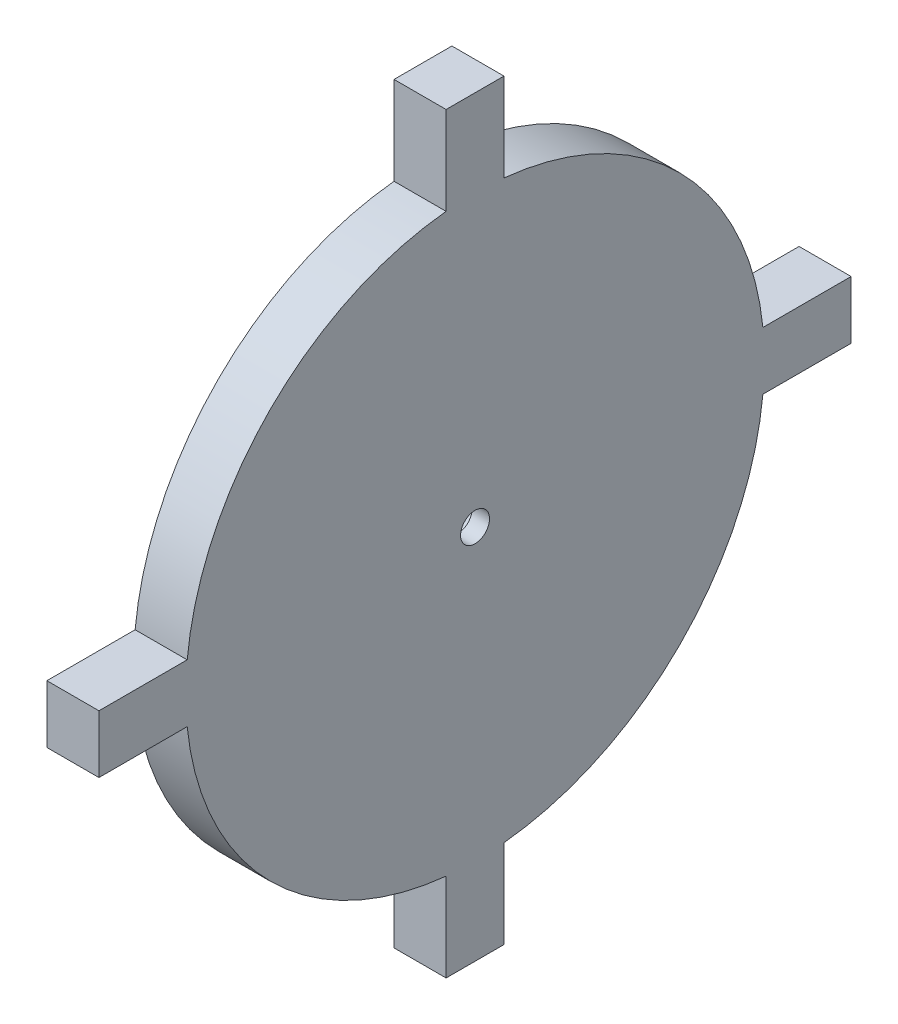
ISO-10303-21;
HEADER;
FILE_DESCRIPTION(('STEP AP214'),'2;1');
FILE_NAME('part.step','',(''),(''),'','','');
FILE_SCHEMA(('AUTOMOTIVE_DESIGN { 1 0 10303 214 1 1 1 1 }'));
ENDSEC;
DATA;
#1=APPLICATION_CONTEXT('core data for automotive mechanical design processes');
#2=APPLICATION_PROTOCOL_DEFINITION('international standard','automotive_design',2000,#1);
#3=PRODUCT_CONTEXT('',#1,'mechanical');
#4=PRODUCT('Part','Part','',(#3));
#5=PRODUCT_RELATED_PRODUCT_CATEGORY('part','',(#4));
#6=PRODUCT_DEFINITION_FORMATION('','',#4);
#7=PRODUCT_DEFINITION_CONTEXT('part definition',#1,'design');
#8=PRODUCT_DEFINITION('design','',#6,#7);
#9=PRODUCT_DEFINITION_SHAPE('','',#8);
#10=(LENGTH_UNIT() NAMED_UNIT(*) SI_UNIT(.MILLI.,.METRE.));
#11=(NAMED_UNIT(*) PLANE_ANGLE_UNIT() SI_UNIT($,.RADIAN.));
#12=(NAMED_UNIT(*) SI_UNIT($,.STERADIAN.) SOLID_ANGLE_UNIT());
#13=UNCERTAINTY_MEASURE_WITH_UNIT(LENGTH_MEASURE(1.E-05),#10,'distance_accuracy_value','');
#14=(GEOMETRIC_REPRESENTATION_CONTEXT(3) GLOBAL_UNCERTAINTY_ASSIGNED_CONTEXT((#13)) GLOBAL_UNIT_ASSIGNED_CONTEXT((#10,
#11,#12)) REPRESENTATION_CONTEXT('',''));
#15=CARTESIAN_POINT('',(0.,0.,0.));
#16=DIRECTION('',(0.,0.,1.));
#17=DIRECTION('',(1.,0.,0.));
#18=AXIS2_PLACEMENT_3D('',#15,#16,#17);
#19=CARTESIAN_POINT('',(11.43,0.,0.));
#20=DIRECTION('',(-1.,0.,0.));
#21=DIRECTION('',(0.,0.,1.));
#22=AXIS2_PLACEMENT_3D('',#19,#20,#21);
#23=CYLINDRICAL_SURFACE('',#22,3.175);
#24=CARTESIAN_POINT('',(11.43,0.,0.));
#25=DIRECTION('',(1.,0.,0.));
#26=DIRECTION('',(0.,0.,-1.));
#27=AXIS2_PLACEMENT_3D('',#24,#25,#26);
#28=CIRCLE('',#27,3.175);
#29=CARTESIAN_POINT('',(11.43,0.,-3.175));
#30=VERTEX_POINT('',#29);
#31=EDGE_CURVE('E176',#30,#30,#28,.T.);
#32=ORIENTED_EDGE('',*,*,#31,.T.);
#33=EDGE_LOOP('',(#32));
#34=FACE_BOUND('',#33,.T.);
#35=CARTESIAN_POINT('',(7.62,0.,0.));
#36=DIRECTION('',(-1.,0.,0.));
#37=DIRECTION('',(0.,0.,1.));
#38=AXIS2_PLACEMENT_3D('',#35,#36,#37);
#39=CIRCLE('',#38,3.175);
#40=CARTESIAN_POINT('',(7.62,0.,3.175));
#41=VERTEX_POINT('',#40);
#42=EDGE_CURVE('E39',#41,#41,#39,.T.);
#43=ORIENTED_EDGE('',*,*,#42,.T.);
#44=EDGE_LOOP('',(#43));
#45=FACE_BOUND('',#44,.T.);
#46=ADVANCED_FACE('F35',(#34,#45),#23,.F.);
#47=CARTESIAN_POINT('',(11.43,0.,0.));
#48=DIRECTION('',(-1.,0.,0.));
#49=DIRECTION('',(0.,0.,1.));
#50=AXIS2_PLACEMENT_3D('',#47,#48,#49);
#51=CYLINDRICAL_SURFACE('',#50,63.5);
#52=CARTESIAN_POINT('',(0.,0.,0.));
#53=DIRECTION('',(1.,0.,0.));
#54=DIRECTION('',(0.,0.,-1.));
#55=AXIS2_PLACEMENT_3D('',#52,#53,#54);
#56=CIRCLE('',#55,63.5);
#57=CARTESIAN_POINT('',(0.,63.1817022562704,6.35000000000001));
#58=VERTEX_POINT('',#57);
#59=CARTESIAN_POINT('',(0.,6.35,63.1817022562704));
#60=VERTEX_POINT('',#59);
#61=EDGE_CURVE('E183',#58,#60,#56,.T.);
#62=ORIENTED_EDGE('',*,*,#61,.T.);
#63=DIRECTION('',(-1.,0.,0.));
#64=VECTOR('',#63,1.);
#65=CARTESIAN_POINT('',(11.43,6.35,63.1817022562704));
#66=LINE('',#65,#64);
#67=CARTESIAN_POINT('',(11.43,6.35,63.1817022562704));
#68=VERTEX_POINT('',#67);
#69=EDGE_CURVE('E11',#68,#60,#66,.T.);
#70=ORIENTED_EDGE('',*,*,#69,.F.);
#71=CARTESIAN_POINT('',(11.43,0.,0.));
#72=DIRECTION('',(1.,0.,0.));
#73=DIRECTION('',(0.,0.,-1.));
#74=AXIS2_PLACEMENT_3D('',#71,#72,#73);
#75=CIRCLE('',#74,63.5);
#76=CARTESIAN_POINT('',(11.43,63.1817022562704,6.35000000000001));
#77=VERTEX_POINT('',#76);
#78=EDGE_CURVE('E113',#77,#68,#75,.T.);
#79=ORIENTED_EDGE('',*,*,#78,.F.);
#80=DIRECTION('',(-1.,0.,0.));
#81=VECTOR('',#80,1.);
#82=CARTESIAN_POINT('',(11.43,63.1817022562704,6.35000000000001));
#83=LINE('',#82,#81);
#84=EDGE_CURVE('E182',#77,#58,#83,.T.);
#85=ORIENTED_EDGE('',*,*,#84,.T.);
#86=EDGE_LOOP('',(#62,#70,#79,#85));
#87=FACE_BOUND('',#86,.T.);
#88=ADVANCED_FACE('F37',(#87),#51,.T.);
#89=CARTESIAN_POINT('',(11.43,6.35,0.));
#90=DIRECTION('',(0.,1.,0.));
#91=DIRECTION('',(0.,0.,1.));
#92=AXIS2_PLACEMENT_3D('',#89,#90,#91);
#93=PLANE('',#92);
#94=DIRECTION('',(0.,0.,-1.));
#95=VECTOR('',#94,1.);
#96=CARTESIAN_POINT('',(0.,6.35,0.));
#97=LINE('',#96,#95);
#98=CARTESIAN_POINT('',(0.,6.35,82.55));
#99=VERTEX_POINT('',#98);
#100=EDGE_CURVE('E186',#99,#60,#97,.T.);
#101=ORIENTED_EDGE('',*,*,#100,.F.);
#102=DIRECTION('',(-1.,0.,0.));
#103=VECTOR('',#102,1.);
#104=CARTESIAN_POINT('',(11.43,6.35,82.55));
#105=LINE('',#104,#103);
#106=CARTESIAN_POINT('',(11.43,6.35,82.55));
#107=VERTEX_POINT('',#106);
#108=EDGE_CURVE('E45',#107,#99,#105,.T.);
#109=ORIENTED_EDGE('',*,*,#108,.F.);
#110=DIRECTION('',(0.,0.,-1.));
#111=VECTOR('',#110,1.);
#112=CARTESIAN_POINT('',(11.43,6.35,0.));
#113=LINE('',#112,#111);
#114=EDGE_CURVE('E563',#107,#68,#113,.T.);
#115=ORIENTED_EDGE('',*,*,#114,.T.);
#116=ORIENTED_EDGE('',*,*,#69,.T.);
#117=EDGE_LOOP('',(#101,#109,#115,#116));
#118=FACE_BOUND('',#117,.T.);
#119=ADVANCED_FACE('F258',(#118),#93,.T.);
#120=CARTESIAN_POINT('',(11.43,0.,82.55));
#121=DIRECTION('',(0.,0.,1.));
#122=DIRECTION('',(1.,0.,0.));
#123=AXIS2_PLACEMENT_3D('',#120,#121,#122);
#124=PLANE('',#123);
#125=DIRECTION('',(0.,1.,0.));
#126=VECTOR('',#125,1.);
#127=CARTESIAN_POINT('',(0.,0.,82.55));
#128=LINE('',#127,#126);
#129=CARTESIAN_POINT('',(0.,-6.35,82.55));
#130=VERTEX_POINT('',#129);
#131=EDGE_CURVE('E189',#130,#99,#128,.T.);
#132=ORIENTED_EDGE('',*,*,#131,.F.);
#133=DIRECTION('',(-1.,0.,0.));
#134=VECTOR('',#133,1.);
#135=CARTESIAN_POINT('',(11.43,-6.35,82.55));
#136=LINE('',#135,#134);
#137=CARTESIAN_POINT('',(11.43,-6.35,82.55));
#138=VERTEX_POINT('',#137);
#139=EDGE_CURVE('E247',#138,#130,#136,.T.);
#140=ORIENTED_EDGE('',*,*,#139,.F.);
#141=DIRECTION('',(0.,1.,0.));
#142=VECTOR('',#141,1.);
#143=CARTESIAN_POINT('',(11.43,0.,82.55));
#144=LINE('',#143,#142);
#145=EDGE_CURVE('E255',#138,#107,#144,.T.);
#146=ORIENTED_EDGE('',*,*,#145,.T.);
#147=ORIENTED_EDGE('',*,*,#108,.T.);
#148=EDGE_LOOP('',(#132,#140,#146,#147));
#149=FACE_BOUND('',#148,.T.);
#150=ADVANCED_FACE('F253',(#149),#124,.T.);
#151=CARTESIAN_POINT('',(11.43,-6.35,0.));
#152=DIRECTION('',(0.,1.,0.));
#153=DIRECTION('',(0.,0.,1.));
#154=AXIS2_PLACEMENT_3D('',#151,#152,#153);
#155=PLANE('',#154);
#156=DIRECTION('',(0.,0.,-1.));
#157=VECTOR('',#156,1.);
#158=CARTESIAN_POINT('',(0.,-6.35,0.));
#159=LINE('',#158,#157);
#160=CARTESIAN_POINT('',(0.,-6.35,63.1817022562704));
#161=VERTEX_POINT('',#160);
#162=EDGE_CURVE('E192',#130,#161,#159,.T.);
#163=ORIENTED_EDGE('',*,*,#162,.T.);
#164=DIRECTION('',(-1.,0.,0.));
#165=VECTOR('',#164,1.);
#166=CARTESIAN_POINT('',(11.43,-6.35,63.1817022562704));
#167=LINE('',#166,#165);
#168=CARTESIAN_POINT('',(11.43,-6.35,63.1817022562704));
#169=VERTEX_POINT('',#168);
#170=EDGE_CURVE('E244',#169,#161,#167,.T.);
#171=ORIENTED_EDGE('',*,*,#170,.F.);
#172=DIRECTION('',(0.,0.,-1.));
#173=VECTOR('',#172,1.);
#174=CARTESIAN_POINT('',(11.43,-6.35,0.));
#175=LINE('',#174,#173);
#176=EDGE_CURVE('E276',#138,#169,#175,.T.);
#177=ORIENTED_EDGE('',*,*,#176,.F.);
#178=ORIENTED_EDGE('',*,*,#139,.T.);
#179=EDGE_LOOP('',(#163,#171,#177,#178));
#180=FACE_BOUND('',#179,.T.);
#181=ADVANCED_FACE('F267',(#180),#155,.F.);
#182=CARTESIAN_POINT('',(11.43,0.,0.));
#183=DIRECTION('',(-1.,0.,0.));
#184=DIRECTION('',(0.,0.,1.));
#185=AXIS2_PLACEMENT_3D('',#182,#183,#184);
#186=CYLINDRICAL_SURFACE('',#185,63.5);
#187=CARTESIAN_POINT('',(0.,0.,0.));
#188=DIRECTION('',(1.,0.,0.));
#189=DIRECTION('',(0.,0.,-1.));
#190=AXIS2_PLACEMENT_3D('',#187,#188,#189);
#191=CIRCLE('',#190,63.5);
#192=CARTESIAN_POINT('',(0.,-63.1817022562704,6.34999999999999));
#193=VERTEX_POINT('',#192);
#194=EDGE_CURVE('E194',#161,#193,#191,.T.);
#195=ORIENTED_EDGE('',*,*,#194,.T.);
#196=DIRECTION('',(-1.,0.,0.));
#197=VECTOR('',#196,1.);
#198=CARTESIAN_POINT('',(11.43,-63.1817022562704,6.34999999999999));
#199=LINE('',#198,#197);
#200=CARTESIAN_POINT('',(11.43,-63.1817022562704,6.34999999999999));
#201=VERTEX_POINT('',#200);
#202=EDGE_CURVE('E241',#201,#193,#199,.T.);
#203=ORIENTED_EDGE('',*,*,#202,.F.);
#204=CARTESIAN_POINT('',(11.43,0.,0.));
#205=DIRECTION('',(1.,0.,0.));
#206=DIRECTION('',(0.,0.,-1.));
#207=AXIS2_PLACEMENT_3D('',#204,#205,#206);
#208=CIRCLE('',#207,63.5);
#209=EDGE_CURVE('E273',#169,#201,#208,.T.);
#210=ORIENTED_EDGE('',*,*,#209,.F.);
#211=ORIENTED_EDGE('',*,*,#170,.T.);
#212=EDGE_LOOP('',(#195,#203,#210,#211));
#213=FACE_BOUND('',#212,.T.);
#214=ADVANCED_FACE('F271',(#213),#186,.T.);
#215=CARTESIAN_POINT('',(11.43,0.,6.35));
#216=DIRECTION('',(0.,0.,-1.));
#217=DIRECTION('',(0.,1.,0.));
#218=AXIS2_PLACEMENT_3D('',#215,#216,#217);
#219=PLANE('',#218);
#220=DIRECTION('',(0.,-1.,0.));
#221=VECTOR('',#220,1.);
#222=CARTESIAN_POINT('',(0.,0.,6.35));
#223=LINE('',#222,#221);
#224=CARTESIAN_POINT('',(0.,-82.55,6.34999999999999));
#225=VERTEX_POINT('',#224);
#226=EDGE_CURVE('E196',#193,#225,#223,.T.);
#227=ORIENTED_EDGE('',*,*,#226,.T.);
#228=DIRECTION('',(-1.,0.,0.));
#229=VECTOR('',#228,1.);
#230=CARTESIAN_POINT('',(11.43,-82.55,6.34999999999999));
#231=LINE('',#230,#229);
#232=CARTESIAN_POINT('',(11.43,-82.55,6.34999999999999));
#233=VERTEX_POINT('',#232);
#234=EDGE_CURVE('E238',#233,#225,#231,.T.);
#235=ORIENTED_EDGE('',*,*,#234,.F.);
#236=DIRECTION('',(0.,-1.,0.));
#237=VECTOR('',#236,1.);
#238=CARTESIAN_POINT('',(11.43,0.,6.35));
#239=LINE('',#238,#237);
#240=EDGE_CURVE('E275',#201,#233,#239,.T.);
#241=ORIENTED_EDGE('',*,*,#240,.F.);
#242=ORIENTED_EDGE('',*,*,#202,.T.);
#243=EDGE_LOOP('',(#227,#235,#241,#242));
#244=FACE_BOUND('',#243,.T.);
#245=ADVANCED_FACE('F487',(#244),#219,.F.);
#246=CARTESIAN_POINT('',(11.43,-82.55,0.));
#247=DIRECTION('',(0.,1.,0.));
#248=DIRECTION('',(0.,0.,1.));
#249=AXIS2_PLACEMENT_3D('',#246,#247,#248);
#250=PLANE('',#249);
#251=DIRECTION('',(0.,0.,-1.));
#252=VECTOR('',#251,1.);
#253=CARTESIAN_POINT('',(0.,-82.55,0.));
#254=LINE('',#253,#252);
#255=CARTESIAN_POINT('',(0.,-82.55,-6.35000000000001));
#256=VERTEX_POINT('',#255);
#257=EDGE_CURVE('E198',#225,#256,#254,.T.);
#258=ORIENTED_EDGE('',*,*,#257,.T.);
#259=DIRECTION('',(-1.,0.,0.));
#260=VECTOR('',#259,1.);
#261=CARTESIAN_POINT('',(11.43,-82.55,-6.35000000000001));
#262=LINE('',#261,#260);
#263=CARTESIAN_POINT('',(11.43,-82.55,-6.35000000000001));
#264=VERTEX_POINT('',#263);
#265=EDGE_CURVE('E236',#264,#256,#262,.T.);
#266=ORIENTED_EDGE('',*,*,#265,.F.);
#267=DIRECTION('',(0.,0.,-1.));
#268=VECTOR('',#267,1.);
#269=CARTESIAN_POINT('',(11.43,-82.55,0.));
#270=LINE('',#269,#268);
#271=EDGE_CURVE('E278',#233,#264,#270,.T.);
#272=ORIENTED_EDGE('',*,*,#271,.F.);
#273=ORIENTED_EDGE('',*,*,#234,.T.);
#274=EDGE_LOOP('',(#258,#266,#272,#273));
#275=FACE_BOUND('',#274,.T.);
#276=ADVANCED_FACE('F478',(#275),#250,.F.);
#277=CARTESIAN_POINT('',(11.43,0.,-6.35));
#278=DIRECTION('',(0.,0.,-1.));
#279=DIRECTION('',(0.,1.,0.));
#280=AXIS2_PLACEMENT_3D('',#277,#278,#279);
#281=PLANE('',#280);
#282=DIRECTION('',(0.,-1.,0.));
#283=VECTOR('',#282,1.);
#284=CARTESIAN_POINT('',(0.,0.,-6.35));
#285=LINE('',#284,#283);
#286=CARTESIAN_POINT('',(0.,-63.1817022562704,-6.35000000000001));
#287=VERTEX_POINT('',#286);
#288=EDGE_CURVE('E201',#287,#256,#285,.T.);
#289=ORIENTED_EDGE('',*,*,#288,.F.);
#290=DIRECTION('',(-1.,0.,0.));
#291=VECTOR('',#290,1.);
#292=CARTESIAN_POINT('',(11.43,-63.1817022562704,-6.35000000000001));
#293=LINE('',#292,#291);
#294=CARTESIAN_POINT('',(11.43,-63.1817022562704,-6.35000000000001));
#295=VERTEX_POINT('',#294);
#296=EDGE_CURVE('E234',#295,#287,#293,.T.);
#297=ORIENTED_EDGE('',*,*,#296,.F.);
#298=DIRECTION('',(0.,-1.,0.));
#299=VECTOR('',#298,1.);
#300=CARTESIAN_POINT('',(11.43,0.,-6.35));
#301=LINE('',#300,#299);
#302=EDGE_CURVE('E284',#295,#264,#301,.T.);
#303=ORIENTED_EDGE('',*,*,#302,.T.);
#304=ORIENTED_EDGE('',*,*,#265,.T.);
#305=EDGE_LOOP('',(#289,#297,#303,#304));
#306=FACE_BOUND('',#305,.T.);
#307=ADVANCED_FACE('F469',(#306),#281,.T.);
#308=CARTESIAN_POINT('',(11.43,0.,0.));
#309=DIRECTION('',(-1.,0.,0.));
#310=DIRECTION('',(0.,0.,1.));
#311=AXIS2_PLACEMENT_3D('',#308,#309,#310);
#312=CYLINDRICAL_SURFACE('',#311,63.5);
#313=CARTESIAN_POINT('',(0.,0.,0.));
#314=DIRECTION('',(1.,0.,0.));
#315=DIRECTION('',(0.,0.,-1.));
#316=AXIS2_PLACEMENT_3D('',#313,#314,#315);
#317=CIRCLE('',#316,63.5);
#318=CARTESIAN_POINT('',(0.,-6.35,-63.1817022562704));
#319=VERTEX_POINT('',#318);
#320=EDGE_CURVE('E204',#287,#319,#317,.T.);
#321=ORIENTED_EDGE('',*,*,#320,.T.);
#322=DIRECTION('',(-1.,0.,0.));
#323=VECTOR('',#322,1.);
#324=CARTESIAN_POINT('',(11.43,-6.35,-63.1817022562704));
#325=LINE('',#324,#323);
#326=CARTESIAN_POINT('',(11.43,-6.35,-63.1817022562704));
#327=VERTEX_POINT('',#326);
#328=EDGE_CURVE('E231',#327,#319,#325,.T.);
#329=ORIENTED_EDGE('',*,*,#328,.F.);
#330=CARTESIAN_POINT('',(11.43,0.,0.));
#331=DIRECTION('',(1.,0.,0.));
#332=DIRECTION('',(0.,0.,-1.));
#333=AXIS2_PLACEMENT_3D('',#330,#331,#332);
#334=CIRCLE('',#333,63.5);
#335=EDGE_CURVE('E287',#295,#327,#334,.T.);
#336=ORIENTED_EDGE('',*,*,#335,.F.);
#337=ORIENTED_EDGE('',*,*,#296,.T.);
#338=EDGE_LOOP('',(#321,#329,#336,#337));
#339=FACE_BOUND('',#338,.T.);
#340=ADVANCED_FACE('F460',(#339),#312,.T.);
#341=CARTESIAN_POINT('',(11.43,-6.35,0.));
#342=DIRECTION('',(0.,1.,0.));
#343=DIRECTION('',(0.,0.,1.));
#344=AXIS2_PLACEMENT_3D('',#341,#342,#343);
#345=PLANE('',#344);
#346=DIRECTION('',(0.,0.,-1.));
#347=VECTOR('',#346,1.);
#348=CARTESIAN_POINT('',(0.,-6.35,0.));
#349=LINE('',#348,#347);
#350=CARTESIAN_POINT('',(0.,-6.35,-82.55));
#351=VERTEX_POINT('',#350);
#352=EDGE_CURVE('E206',#319,#351,#349,.T.);
#353=ORIENTED_EDGE('',*,*,#352,.T.);
#354=DIRECTION('',(-1.,0.,0.));
#355=VECTOR('',#354,1.);
#356=CARTESIAN_POINT('',(11.43,-6.35,-82.55));
#357=LINE('',#356,#355);
#358=CARTESIAN_POINT('',(11.43,-6.35,-82.55));
#359=VERTEX_POINT('',#358);
#360=EDGE_CURVE('E228',#359,#351,#357,.T.);
#361=ORIENTED_EDGE('',*,*,#360,.F.);
#362=DIRECTION('',(0.,0.,-1.));
#363=VECTOR('',#362,1.);
#364=CARTESIAN_POINT('',(11.43,-6.35,0.));
#365=LINE('',#364,#363);
#366=EDGE_CURVE('E289',#327,#359,#365,.T.);
#367=ORIENTED_EDGE('',*,*,#366,.F.);
#368=ORIENTED_EDGE('',*,*,#328,.T.);
#369=EDGE_LOOP('',(#353,#361,#367,#368));
#370=FACE_BOUND('',#369,.T.);
#371=ADVANCED_FACE('F452',(#370),#345,.F.);
#372=CARTESIAN_POINT('',(11.43,0.,-82.55));
#373=DIRECTION('',(0.,0.,1.));
#374=DIRECTION('',(1.,0.,0.));
#375=AXIS2_PLACEMENT_3D('',#372,#373,#374);
#376=PLANE('',#375);
#377=DIRECTION('',(0.,1.,0.));
#378=VECTOR('',#377,1.);
#379=CARTESIAN_POINT('',(0.,0.,-82.55));
#380=LINE('',#379,#378);
#381=CARTESIAN_POINT('',(0.,6.35,-82.55));
#382=VERTEX_POINT('',#381);
#383=EDGE_CURVE('E208',#351,#382,#380,.T.);
#384=ORIENTED_EDGE('',*,*,#383,.T.);
#385=DIRECTION('',(-1.,0.,0.));
#386=VECTOR('',#385,1.);
#387=CARTESIAN_POINT('',(11.43,6.35,-82.55));
#388=LINE('',#387,#386);
#389=CARTESIAN_POINT('',(11.43,6.35,-82.55));
#390=VERTEX_POINT('',#389);
#391=EDGE_CURVE('E226',#390,#382,#388,.T.);
#392=ORIENTED_EDGE('',*,*,#391,.F.);
#393=DIRECTION('',(0.,1.,0.));
#394=VECTOR('',#393,1.);
#395=CARTESIAN_POINT('',(11.43,0.,-82.55));
#396=LINE('',#395,#394);
#397=EDGE_CURVE('E291',#359,#390,#396,.T.);
#398=ORIENTED_EDGE('',*,*,#397,.F.);
#399=ORIENTED_EDGE('',*,*,#360,.T.);
#400=EDGE_LOOP('',(#384,#392,#398,#399));
#401=FACE_BOUND('',#400,.T.);
#402=ADVANCED_FACE('F303',(#401),#376,.F.);
#403=CARTESIAN_POINT('',(11.43,6.35,0.));
#404=DIRECTION('',(0.,1.,0.));
#405=DIRECTION('',(0.,0.,1.));
#406=AXIS2_PLACEMENT_3D('',#403,#404,#405);
#407=PLANE('',#406);
#408=DIRECTION('',(0.,0.,-1.));
#409=VECTOR('',#408,1.);
#410=CARTESIAN_POINT('',(0.,6.35,0.));
#411=LINE('',#410,#409);
#412=CARTESIAN_POINT('',(0.,6.35,-63.1817022562704));
#413=VERTEX_POINT('',#412);
#414=EDGE_CURVE('E211',#413,#382,#411,.T.);
#415=ORIENTED_EDGE('',*,*,#414,.F.);
#416=DIRECTION('',(-1.,0.,0.));
#417=VECTOR('',#416,1.);
#418=CARTESIAN_POINT('',(11.43,6.35,-63.1817022562704));
#419=LINE('',#418,#417);
#420=CARTESIAN_POINT('',(11.43,6.35,-63.1817022562704));
#421=VERTEX_POINT('',#420);
#422=EDGE_CURVE('E224',#421,#413,#419,.T.);
#423=ORIENTED_EDGE('',*,*,#422,.F.);
#424=DIRECTION('',(0.,0.,-1.));
#425=VECTOR('',#424,1.);
#426=CARTESIAN_POINT('',(11.43,6.35,0.));
#427=LINE('',#426,#425);
#428=EDGE_CURVE('E293',#421,#390,#427,.T.);
#429=ORIENTED_EDGE('',*,*,#428,.T.);
#430=ORIENTED_EDGE('',*,*,#391,.T.);
#431=EDGE_LOOP('',(#415,#423,#429,#430));
#432=FACE_BOUND('',#431,.T.);
#433=ADVANCED_FACE('F297',(#432),#407,.T.);
#434=CARTESIAN_POINT('',(11.43,0.,0.));
#435=DIRECTION('',(-1.,0.,0.));
#436=DIRECTION('',(0.,0.,1.));
#437=AXIS2_PLACEMENT_3D('',#434,#435,#436);
#438=CYLINDRICAL_SURFACE('',#437,63.5);
#439=CARTESIAN_POINT('',(0.,0.,0.));
#440=DIRECTION('',(1.,0.,0.));
#441=DIRECTION('',(0.,0.,-1.));
#442=AXIS2_PLACEMENT_3D('',#439,#440,#441);
#443=CIRCLE('',#442,63.5);
#444=CARTESIAN_POINT('',(0.,63.1817022562704,-6.34999999999999));
#445=VERTEX_POINT('',#444);
#446=EDGE_CURVE('E214',#413,#445,#443,.T.);
#447=ORIENTED_EDGE('',*,*,#446,.T.);
#448=DIRECTION('',(-1.,0.,0.));
#449=VECTOR('',#448,1.);
#450=CARTESIAN_POINT('',(11.43,63.1817022562704,-6.34999999999999));
#451=LINE('',#450,#449);
#452=CARTESIAN_POINT('',(11.43,63.1817022562704,-6.34999999999999));
#453=VERTEX_POINT('',#452);
#454=EDGE_CURVE('E164',#453,#445,#451,.T.);
#455=ORIENTED_EDGE('',*,*,#454,.F.);
#456=CARTESIAN_POINT('',(11.43,0.,0.));
#457=DIRECTION('',(1.,0.,0.));
#458=DIRECTION('',(0.,0.,-1.));
#459=AXIS2_PLACEMENT_3D('',#456,#457,#458);
#460=CIRCLE('',#459,63.5);
#461=EDGE_CURVE('E171',#421,#453,#460,.T.);
#462=ORIENTED_EDGE('',*,*,#461,.F.);
#463=ORIENTED_EDGE('',*,*,#422,.T.);
#464=EDGE_LOOP('',(#447,#455,#462,#463));
#465=FACE_BOUND('',#464,.T.);
#466=ADVANCED_FACE('F308',(#465),#438,.T.);
#467=CARTESIAN_POINT('',(11.43,0.,-6.35));
#468=DIRECTION('',(0.,0.,-1.));
#469=DIRECTION('',(0.,1.,0.));
#470=AXIS2_PLACEMENT_3D('',#467,#468,#469);
#471=PLANE('',#470);
#472=DIRECTION('',(0.,-1.,0.));
#473=VECTOR('',#472,1.);
#474=CARTESIAN_POINT('',(0.,0.,-6.35));
#475=LINE('',#474,#473);
#476=CARTESIAN_POINT('',(0.,82.55,-6.34999999999999));
#477=VERTEX_POINT('',#476);
#478=EDGE_CURVE('E159',#477,#445,#475,.T.);
#479=ORIENTED_EDGE('',*,*,#478,.F.);
#480=DIRECTION('',(-1.,0.,0.));
#481=VECTOR('',#480,1.);
#482=CARTESIAN_POINT('',(11.43,82.55,-6.34999999999999));
#483=LINE('',#482,#481);
#484=CARTESIAN_POINT('',(11.43,82.55,-6.34999999999999));
#485=VERTEX_POINT('',#484);
#486=EDGE_CURVE('E154',#485,#477,#483,.T.);
#487=ORIENTED_EDGE('',*,*,#486,.F.);
#488=DIRECTION('',(0.,-1.,0.));
#489=VECTOR('',#488,1.);
#490=CARTESIAN_POINT('',(11.43,0.,-6.35));
#491=LINE('',#490,#489);
#492=EDGE_CURVE('E157',#485,#453,#491,.T.);
#493=ORIENTED_EDGE('',*,*,#492,.T.);
#494=ORIENTED_EDGE('',*,*,#454,.T.);
#495=EDGE_LOOP('',(#479,#487,#493,#494));
#496=FACE_BOUND('',#495,.T.);
#497=ADVANCED_FACE('F156',(#496),#471,.T.);
#498=CARTESIAN_POINT('',(11.43,82.55,0.));
#499=DIRECTION('',(0.,1.,0.));
#500=DIRECTION('',(0.,0.,1.));
#501=AXIS2_PLACEMENT_3D('',#498,#499,#500);
#502=PLANE('',#501);
#503=DIRECTION('',(0.,0.,-1.));
#504=VECTOR('',#503,1.);
#505=CARTESIAN_POINT('',(0.,82.55,0.));
#506=LINE('',#505,#504);
#507=CARTESIAN_POINT('',(0.,82.55,6.35000000000001));
#508=VERTEX_POINT('',#507);
#509=EDGE_CURVE('E218',#508,#477,#506,.T.);
#510=ORIENTED_EDGE('',*,*,#509,.F.);
#511=DIRECTION('',(-1.,0.,0.));
#512=VECTOR('',#511,1.);
#513=CARTESIAN_POINT('',(11.43,82.55,6.35000000000001));
#514=LINE('',#513,#512);
#515=CARTESIAN_POINT('',(11.43,82.55,6.35000000000001));
#516=VERTEX_POINT('',#515);
#517=EDGE_CURVE('E104',#516,#508,#514,.T.);
#518=ORIENTED_EDGE('',*,*,#517,.F.);
#519=DIRECTION('',(0.,0.,-1.));
#520=VECTOR('',#519,1.);
#521=CARTESIAN_POINT('',(11.43,82.55,0.));
#522=LINE('',#521,#520);
#523=EDGE_CURVE('E168',#516,#485,#522,.T.);
#524=ORIENTED_EDGE('',*,*,#523,.T.);
#525=ORIENTED_EDGE('',*,*,#486,.T.);
#526=EDGE_LOOP('',(#510,#518,#524,#525));
#527=FACE_BOUND('',#526,.T.);
#528=ADVANCED_FACE('F174',(#527),#502,.T.);
#529=CARTESIAN_POINT('',(11.43,0.,6.35));
#530=DIRECTION('',(0.,0.,-1.));
#531=DIRECTION('',(0.,1.,0.));
#532=AXIS2_PLACEMENT_3D('',#529,#530,#531);
#533=PLANE('',#532);
#534=DIRECTION('',(0.,-1.,0.));
#535=VECTOR('',#534,1.);
#536=CARTESIAN_POINT('',(0.,0.,6.35));
#537=LINE('',#536,#535);
#538=EDGE_CURVE('E107',#508,#58,#537,.T.);
#539=ORIENTED_EDGE('',*,*,#538,.T.);
#540=ORIENTED_EDGE('',*,*,#84,.F.);
#541=DIRECTION('',(0.,-1.,0.));
#542=VECTOR('',#541,1.);
#543=CARTESIAN_POINT('',(11.43,0.,6.35));
#544=LINE('',#543,#542);
#545=EDGE_CURVE('E53',#516,#77,#544,.T.);
#546=ORIENTED_EDGE('',*,*,#545,.F.);
#547=ORIENTED_EDGE('',*,*,#517,.T.);
#548=EDGE_LOOP('',(#539,#540,#546,#547));
#549=FACE_BOUND('',#548,.T.);
#550=ADVANCED_FACE('F328',(#549),#533,.F.);
#551=CARTESIAN_POINT('',(11.43,0.,0.));
#552=DIRECTION('',(1.,0.,0.));
#553=DIRECTION('',(0.,0.,-1.));
#554=AXIS2_PLACEMENT_3D('',#551,#552,#553);
#555=PLANE('',#554);
#556=ORIENTED_EDGE('',*,*,#78,.T.);
#557=ORIENTED_EDGE('',*,*,#114,.F.);
#558=ORIENTED_EDGE('',*,*,#145,.F.);
#559=ORIENTED_EDGE('',*,*,#176,.T.);
#560=ORIENTED_EDGE('',*,*,#209,.T.);
#561=ORIENTED_EDGE('',*,*,#240,.T.);
#562=ORIENTED_EDGE('',*,*,#271,.T.);
#563=ORIENTED_EDGE('',*,*,#302,.F.);
#564=ORIENTED_EDGE('',*,*,#335,.T.);
#565=ORIENTED_EDGE('',*,*,#366,.T.);
#566=ORIENTED_EDGE('',*,*,#397,.T.);
#567=ORIENTED_EDGE('',*,*,#428,.F.);
#568=ORIENTED_EDGE('',*,*,#461,.T.);
#569=ORIENTED_EDGE('',*,*,#492,.F.);
#570=ORIENTED_EDGE('',*,*,#523,.F.);
#571=ORIENTED_EDGE('',*,*,#545,.T.);
#572=EDGE_LOOP('',(#556,#557,#558,#559,#560,#561,#562,#563,#564,#565,#566,#567,#568,#569,#570,#571));
#573=FACE_BOUND('',#572,.T.);
#574=ORIENTED_EDGE('',*,*,#31,.F.);
#575=EDGE_LOOP('',(#574));
#576=FACE_BOUND('',#575,.T.);
#577=ADVANCED_FACE('F166',(#573,#576),#555,.T.);
#578=CARTESIAN_POINT('',(0.,0.,0.));
#579=DIRECTION('',(1.,0.,0.));
#580=DIRECTION('',(0.,0.,-1.));
#581=AXIS2_PLACEMENT_3D('',#578,#579,#580);
#582=PLANE('',#581);
#583=CARTESIAN_POINT('',(0.,0.,0.));
#584=DIRECTION('',(-1.,0.,0.));
#585=DIRECTION('',(0.,0.,1.));
#586=AXIS2_PLACEMENT_3D('',#583,#584,#585);
#587=CIRCLE('',#586,9.77646460715999);
#588=CARTESIAN_POINT('',(0.,0.,9.77646460715999));
#589=VERTEX_POINT('',#588);
#590=EDGE_CURVE('E557',#589,#589,#587,.T.);
#591=ORIENTED_EDGE('',*,*,#590,.F.);
#592=EDGE_LOOP('',(#591));
#593=FACE_BOUND('',#592,.T.);
#594=ORIENTED_EDGE('',*,*,#61,.F.);
#595=ORIENTED_EDGE('',*,*,#538,.F.);
#596=ORIENTED_EDGE('',*,*,#509,.T.);
#597=ORIENTED_EDGE('',*,*,#478,.T.);
#598=ORIENTED_EDGE('',*,*,#446,.F.);
#599=ORIENTED_EDGE('',*,*,#414,.T.);
#600=ORIENTED_EDGE('',*,*,#383,.F.);
#601=ORIENTED_EDGE('',*,*,#352,.F.);
#602=ORIENTED_EDGE('',*,*,#320,.F.);
#603=ORIENTED_EDGE('',*,*,#288,.T.);
#604=ORIENTED_EDGE('',*,*,#257,.F.);
#605=ORIENTED_EDGE('',*,*,#226,.F.);
#606=ORIENTED_EDGE('',*,*,#194,.F.);
#607=ORIENTED_EDGE('',*,*,#162,.F.);
#608=ORIENTED_EDGE('',*,*,#131,.T.);
#609=ORIENTED_EDGE('',*,*,#100,.T.);
#610=EDGE_LOOP('',(#594,#595,#596,#597,#598,#599,#600,#601,#602,#603,#604,#605,#606,#607,#608,#609));
#611=FACE_BOUND('',#610,.T.);
#612=ADVANCED_FACE('F262',(#593,#611),#582,.F.);
#613=CARTESIAN_POINT('',(7.62,0.,0.));
#614=DIRECTION('',(-1.,0.,0.));
#615=DIRECTION('',(0.,0.,1.));
#616=AXIS2_PLACEMENT_3D('',#613,#614,#615);
#617=CYLINDRICAL_SURFACE('',#616,9.77646460715999);
#618=CARTESIAN_POINT('',(7.62,0.,0.));
#619=DIRECTION('',(-1.,0.,0.));
#620=DIRECTION('',(0.,0.,1.));
#621=AXIS2_PLACEMENT_3D('',#618,#619,#620);
#622=CIRCLE('',#621,9.77646460715999);
#623=CARTESIAN_POINT('',(7.62,0.,9.77646460715999));
#624=VERTEX_POINT('',#623);
#625=EDGE_CURVE('E556',#624,#624,#622,.T.);
#626=ORIENTED_EDGE('',*,*,#625,.F.);
#627=EDGE_LOOP('',(#626));
#628=FACE_BOUND('',#627,.T.);
#629=ORIENTED_EDGE('',*,*,#590,.T.);
#630=EDGE_LOOP('',(#629));
#631=FACE_BOUND('',#630,.T.);
#632=ADVANCED_FACE('F351',(#628,#631),#617,.F.);
#633=CARTESIAN_POINT('',(7.62,0.,0.));
#634=DIRECTION('',(-1.,0.,0.));
#635=DIRECTION('',(0.,0.,1.));
#636=AXIS2_PLACEMENT_3D('',#633,#634,#635);
#637=PLANE('',#636);
#638=ORIENTED_EDGE('',*,*,#42,.F.);
#639=EDGE_LOOP('',(#638));
#640=FACE_BOUND('',#639,.T.);
#641=ORIENTED_EDGE('',*,*,#625,.T.);
#642=EDGE_LOOP('',(#641));
#643=FACE_BOUND('',#642,.T.);
#644=ADVANCED_FACE('F358',(#640,#643),#637,.T.);
#645=CLOSED_SHELL('',(#46,#88,#119,#150,#181,#214,#245,#276,#307,#340,#371,#402,#433,#466,#497,
#528,#550,#577,#612,#632,#644));
#646=MANIFOLD_SOLID_BREP('B2',#645);
#647=ADVANCED_BREP_SHAPE_REPRESENTATION('',(#18,#646),#14);
#648=SHAPE_DEFINITION_REPRESENTATION(#9,#647);
ENDSEC;
END-ISO-10303-21;
